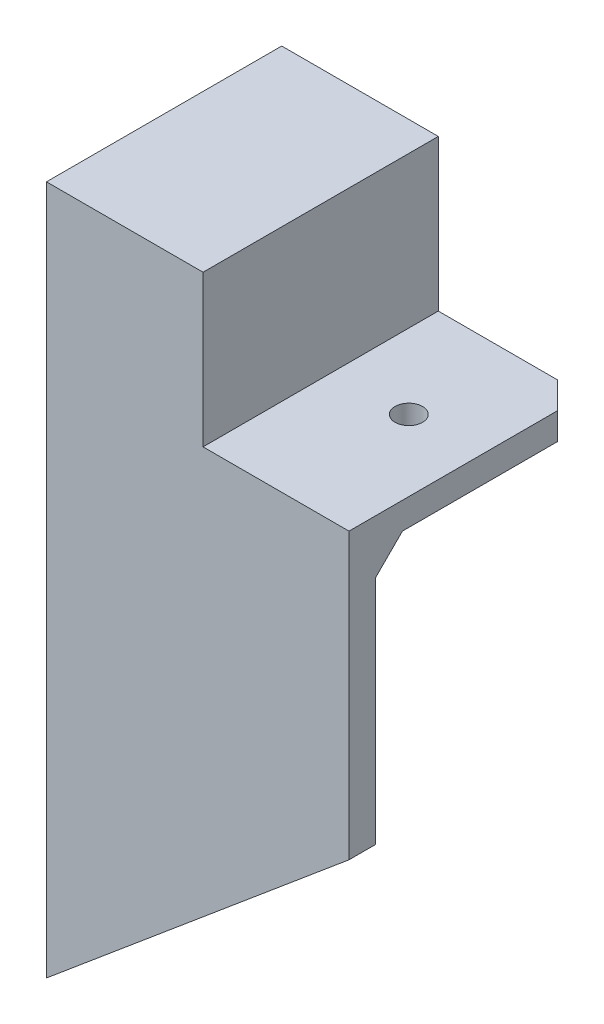
ISO-10303-21;
HEADER;
FILE_DESCRIPTION(('STEP AP214'),'2;1');
FILE_NAME('part.step','',(''),(''),'','','');
FILE_SCHEMA(('AUTOMOTIVE_DESIGN { 1 0 10303 214 1 1 1 1 }'));
ENDSEC;
DATA;
#1=APPLICATION_CONTEXT('core data for automotive mechanical design processes');
#2=APPLICATION_PROTOCOL_DEFINITION('international standard','automotive_design',2000,#1);
#3=PRODUCT_CONTEXT('',#1,'mechanical');
#4=PRODUCT('Part','Part','',(#3));
#5=PRODUCT_RELATED_PRODUCT_CATEGORY('part','',(#4));
#6=PRODUCT_DEFINITION_FORMATION('','',#4);
#7=PRODUCT_DEFINITION_CONTEXT('part definition',#1,'design');
#8=PRODUCT_DEFINITION('design','',#6,#7);
#9=PRODUCT_DEFINITION_SHAPE('','',#8);
#10=(LENGTH_UNIT() NAMED_UNIT(*) SI_UNIT(.MILLI.,.METRE.));
#11=(NAMED_UNIT(*) PLANE_ANGLE_UNIT() SI_UNIT($,.RADIAN.));
#12=(NAMED_UNIT(*) SI_UNIT($,.STERADIAN.) SOLID_ANGLE_UNIT());
#13=UNCERTAINTY_MEASURE_WITH_UNIT(LENGTH_MEASURE(1.E-05),#10,'distance_accuracy_value','');
#14=(GEOMETRIC_REPRESENTATION_CONTEXT(3) GLOBAL_UNCERTAINTY_ASSIGNED_CONTEXT((#13)) GLOBAL_UNIT_ASSIGNED_CONTEXT((#10,
#11,#12)) REPRESENTATION_CONTEXT('',''));
#15=CARTESIAN_POINT('',(0.,0.,0.));
#16=DIRECTION('',(0.,0.,1.));
#17=DIRECTION('',(1.,0.,0.));
#18=AXIS2_PLACEMENT_3D('',#15,#16,#17);
#19=CARTESIAN_POINT('',(0.,0.,-17.4752));
#20=DIRECTION('',(0.,0.,1.));
#21=DIRECTION('',(1.,0.,0.));
#22=AXIS2_PLACEMENT_3D('',#19,#20,#21);
#23=PLANE('',#22);
#24=DIRECTION('',(0.,-1.,0.));
#25=VECTOR('',#24,1.);
#26=CARTESIAN_POINT('',(108.667127984172,-84.1545398464944,-17.4752));
#27=LINE('',#26,#25);
#28=CARTESIAN_POINT('',(108.667127984172,14.27480000001,-17.4752));
#29=VERTEX_POINT('',#28);
#30=CARTESIAN_POINT('',(108.667127984172,-84.1545398464944,-17.4752));
#31=VERTEX_POINT('',#30);
#32=EDGE_CURVE('E307',#29,#31,#27,.T.);
#33=ORIENTED_EDGE('',*,*,#32,.F.);
#34=DIRECTION('',(1.,0.,0.));
#35=VECTOR('',#34,1.);
#36=CARTESIAN_POINT('',(0.,14.2748000000096,-17.4752));
#37=LINE('',#36,#35);
#38=CARTESIAN_POINT('',(112.559255968268,14.27480000001,-17.4752));
#39=VERTEX_POINT('',#38);
#40=EDGE_CURVE('E271',#29,#39,#37,.T.);
#41=ORIENTED_EDGE('',*,*,#40,.T.);
#42=CARTESIAN_POINT('',(112.559255968268,11.09980000001,-17.4752));
#43=DIRECTION('',(0.,0.,1.));
#44=DIRECTION('',(1.,0.,0.));
#45=AXIS2_PLACEMENT_3D('',#42,#43,#44);
#46=CIRCLE('',#45,3.17500000000004);
#47=CARTESIAN_POINT('',(115.542780039264,12.185713955069,-17.4752));
#48=VERTEX_POINT('',#47);
#49=EDGE_CURVE('E274',#39,#48,#46,.F.);
#50=ORIENTED_EDGE('',*,*,#49,.T.);
#51=DIRECTION('',(0.342020143325666,-0.939692620785908,0.));
#52=VECTOR('',#51,1.);
#53=CARTESIAN_POINT('',(105.943255288181,38.5601914461638,-17.4752));
#54=LINE('',#53,#52);
#55=CARTESIAN_POINT('',(124.605061599347,-12.7126999999988,-17.4752));
#56=VERTEX_POINT('',#55);
#57=EDGE_CURVE('E276',#48,#56,#54,.T.);
#58=ORIENTED_EDGE('',*,*,#57,.T.);
#59=DIRECTION('',(1.,0.,0.));
#60=VECTOR('',#59,1.);
#61=CARTESIAN_POINT('',(0.,-12.7126999999992,-17.4752));
#62=LINE('',#61,#60);
#63=CARTESIAN_POINT('',(158.750000000128,-12.7126999999987,-17.4752));
#64=VERTEX_POINT('',#63);
#65=EDGE_CURVE('E278',#56,#64,#62,.T.);
#66=ORIENTED_EDGE('',*,*,#65,.T.);
#67=DIRECTION('',(1.34280688056193E-12,1.,0.));
#68=VECTOR('',#67,1.);
#69=CARTESIAN_POINT('',(158.750000000072,-53.9749999999979,-17.4752));
#70=LINE('',#69,#68);
#71=CARTESIAN_POINT('',(158.750000000072,-53.9749999999979,-17.4752));
#72=VERTEX_POINT('',#71);
#73=EDGE_CURVE('E205',#72,#64,#70,.T.);
#74=ORIENTED_EDGE('',*,*,#73,.F.);
#75=DIRECTION('',(0.766370514024187,0.642398813226106,0.));
#76=VECTOR('',#75,1.);
#77=CARTESIAN_POINT('',(158.750000000072,-53.9749999999979,-17.4752));
#78=LINE('',#77,#76);
#79=CARTESIAN_POINT('',(104.775000000076,-99.2187499999914,-17.4752));
#80=VERTEX_POINT('',#79);
#81=EDGE_CURVE('E203',#80,#72,#78,.T.);
#82=ORIENTED_EDGE('',*,*,#81,.F.);
#83=DIRECTION('',(0.,1.,0.));
#84=VECTOR('',#83,1.);
#85=CARTESIAN_POINT('',(104.775000000076,0.,-17.4752));
#86=LINE('',#85,#84);
#87=CARTESIAN_POINT('',(104.775000000076,-84.1545398464944,-17.4752));
#88=VERTEX_POINT('',#87);
#89=EDGE_CURVE('E59',#80,#88,#86,.T.);
#90=ORIENTED_EDGE('',*,*,#89,.T.);
#91=DIRECTION('',(-1.,0.,0.));
#92=VECTOR('',#91,1.);
#93=CARTESIAN_POINT('',(104.775000000076,-84.1545398464944,-17.4752));
#94=LINE('',#93,#92);
#95=EDGE_CURVE('E54',#31,#88,#94,.T.);
#96=ORIENTED_EDGE('',*,*,#95,.F.);
#97=EDGE_LOOP('',(#33,#41,#50,#58,#66,#74,#82,#90,#96));
#98=FACE_BOUND('',#97,.T.);
#99=ADVANCED_FACE('F37',(#98),#23,.F.);
#100=CARTESIAN_POINT('',(104.775000000076,-99.2187499999912,-57.2235000000003));
#101=DIRECTION('',(1.,0.,0.));
#102=DIRECTION('',(0.,0.,-1.));
#103=AXIS2_PLACEMENT_3D('',#100,#101,#102);
#104=PLANE('',#103);
#105=CARTESIAN_POINT('',(104.775000000076,-74.62519999999,-23.876));
#106=DIRECTION('',(-1.,0.,0.));
#107=DIRECTION('',(0.,0.,1.));
#108=AXIS2_PLACEMENT_3D('',#105,#106,#107);
#109=CIRCLE('',#108,2.54);
#110=CARTESIAN_POINT('',(104.775000000076,-74.62519999999,-21.336));
#111=VERTEX_POINT('',#110);
#112=EDGE_CURVE('E303',#111,#111,#109,.T.);
#113=ORIENTED_EDGE('',*,*,#112,.F.);
#114=EDGE_LOOP('',(#113));
#115=FACE_BOUND('',#114,.T.);
#116=CARTESIAN_POINT('',(104.775000000076,1.57480000000997,-23.876));
#117=DIRECTION('',(-1.,0.,0.));
#118=DIRECTION('',(0.,0.,1.));
#119=AXIS2_PLACEMENT_3D('',#116,#117,#118);
#120=CIRCLE('',#119,2.54);
#121=CARTESIAN_POINT('',(104.775000000076,1.57480000000997,-21.336));
#122=VERTEX_POINT('',#121);
#123=EDGE_CURVE('E309',#122,#122,#120,.T.);
#124=ORIENTED_EDGE('',*,*,#123,.F.);
#125=EDGE_LOOP('',(#124));
#126=FACE_BOUND('',#125,.T.);
#127=DIRECTION('',(0.,0.,1.));
#128=VECTOR('',#127,1.);
#129=CARTESIAN_POINT('',(104.775000000076,-99.218749999991,-17.4752));
#130=LINE('',#129,#128);
#131=CARTESIAN_POINT('',(104.775000000076,-99.2187499999914,-12.7));
#132=VERTEX_POINT('',#131);
#133=EDGE_CURVE('E11',#80,#132,#130,.T.);
#134=ORIENTED_EDGE('',*,*,#133,.T.);
#135=DIRECTION('',(0.,-1.,0.));
#136=VECTOR('',#135,1.);
#137=CARTESIAN_POINT('',(104.775000000076,0.,-12.7));
#138=LINE('',#137,#136);
#139=CARTESIAN_POINT('',(104.775000000076,23.81250000001,-12.7));
#140=VERTEX_POINT('',#139);
#141=EDGE_CURVE('E296',#140,#132,#138,.T.);
#142=ORIENTED_EDGE('',*,*,#141,.F.);
#143=DIRECTION('',(0.,0.,1.));
#144=VECTOR('',#143,1.);
#145=CARTESIAN_POINT('',(104.775000000076,23.8125000000092,-227.168068425539));
#146=LINE('',#145,#144);
#147=CARTESIAN_POINT('',(104.775000000076,23.81250000001,-54.6734999999892));
#148=VERTEX_POINT('',#147);
#149=EDGE_CURVE('E294',#148,#140,#146,.T.);
#150=ORIENTED_EDGE('',*,*,#149,.F.);
#151=DIRECTION('',(0.,1.,0.));
#152=VECTOR('',#151,1.);
#153=CARTESIAN_POINT('',(104.775000000076,15.8749999999788,-54.6734999999892));
#154=LINE('',#153,#152);
#155=CARTESIAN_POINT('',(104.775000000076,19.03730000001,-54.6734999999892));
#156=VERTEX_POINT('',#155);
#157=EDGE_CURVE('E288',#156,#148,#154,.T.);
#158=ORIENTED_EDGE('',*,*,#157,.F.);
#159=DIRECTION('',(0.,0.,1.));
#160=VECTOR('',#159,1.);
#161=CARTESIAN_POINT('',(104.775000000076,19.0373000000092,-227.168068425538));
#162=LINE('',#161,#160);
#163=CARTESIAN_POINT('',(104.775000000076,19.0373000000099,-22.2377));
#164=VERTEX_POINT('',#163);
#165=EDGE_CURVE('E46',#156,#164,#162,.T.);
#166=ORIENTED_EDGE('',*,*,#165,.T.);
#167=DIRECTION('',(0.,0.707106781186542,-0.707106781186553));
#168=VECTOR('',#167,1.);
#169=CARTESIAN_POINT('',(104.775000000076,19.0373000000094,-22.2377000000002));
#170=LINE('',#169,#168);
#171=CARTESIAN_POINT('',(104.775000000076,14.27480000001,-17.4752));
#172=VERTEX_POINT('',#171);
#173=EDGE_CURVE('E185',#172,#164,#170,.T.);
#174=ORIENTED_EDGE('',*,*,#173,.F.);
#175=DIRECTION('',(0.,0.,1.));
#176=VECTOR('',#175,1.);
#177=CARTESIAN_POINT('',(104.775000000076,14.27480000001,-30.1752));
#178=LINE('',#177,#176);
#179=CARTESIAN_POINT('',(104.775000000076,14.27480000001,-30.1752));
#180=VERTEX_POINT('',#179);
#181=EDGE_CURVE('E168',#180,#172,#178,.T.);
#182=ORIENTED_EDGE('',*,*,#181,.F.);
#183=DIRECTION('',(0.,1.,0.));
#184=VECTOR('',#183,1.);
#185=CARTESIAN_POINT('',(104.775000000076,-84.1545398464944,-30.1752));
#186=LINE('',#185,#184);
#187=CARTESIAN_POINT('',(104.775000000076,-84.1545398464944,-30.1752));
#188=VERTEX_POINT('',#187);
#189=EDGE_CURVE('E174',#188,#180,#186,.T.);
#190=ORIENTED_EDGE('',*,*,#189,.F.);
#191=DIRECTION('',(0.,0.,1.));
#192=VECTOR('',#191,1.);
#193=CARTESIAN_POINT('',(104.775000000076,-84.1545398464944,-30.1752));
#194=LINE('',#193,#192);
#195=EDGE_CURVE('E318',#188,#88,#194,.T.);
#196=ORIENTED_EDGE('',*,*,#195,.T.);
#197=ORIENTED_EDGE('',*,*,#89,.F.);
#198=EDGE_LOOP('',(#134,#142,#150,#158,#166,#174,#182,#190,#196,#197));
#199=FACE_BOUND('',#198,.T.);
#200=ADVANCED_FACE('F39',(#115,#126,#199),#104,.F.);
#201=CARTESIAN_POINT('',(-10.7949999999356,19.0373000000096,-227.168068425538));
#202=DIRECTION('',(0.,-1.,0.));
#203=DIRECTION('',(1.,0.,0.));
#204=AXIS2_PLACEMENT_3D('',#201,#202,#203);
#205=PLANE('',#204);
#206=ORIENTED_EDGE('',*,*,#165,.F.);
#207=DIRECTION('',(-1.,0.,0.));
#208=VECTOR('',#207,1.);
#209=CARTESIAN_POINT('',(-10.7949999999356,19.0373000000096,-54.6734999999892));
#210=LINE('',#209,#208);
#211=CARTESIAN_POINT('',(112.559255968268,19.03730000001,-54.673499999989));
#212=VERTEX_POINT('',#211);
#213=EDGE_CURVE('E222',#212,#156,#210,.T.);
#214=ORIENTED_EDGE('',*,*,#213,.F.);
#215=DIRECTION('',(0.,0.,1.));
#216=VECTOR('',#215,1.);
#217=CARTESIAN_POINT('',(112.559255968268,19.03730000001,-17.4751999999999));
#218=LINE('',#217,#216);
#219=CARTESIAN_POINT('',(112.559255968268,19.03730000001,-22.2377));
#220=VERTEX_POINT('',#219);
#221=EDGE_CURVE('E228',#212,#220,#218,.T.);
#222=ORIENTED_EDGE('',*,*,#221,.T.);
#223=DIRECTION('',(-1.,0.,0.));
#224=VECTOR('',#223,1.);
#225=CARTESIAN_POINT('',(-10.7949999999356,19.0373000000096,-22.2377));
#226=LINE('',#225,#224);
#227=EDGE_CURVE('E284',#220,#164,#226,.T.);
#228=ORIENTED_EDGE('',*,*,#227,.T.);
#229=EDGE_LOOP('',(#206,#214,#222,#228));
#230=FACE_BOUND('',#229,.T.);
#231=ADVANCED_FACE('F364',(#230),#205,.T.);
#232=CARTESIAN_POINT('',(-10.7949999999356,19.0373000000096,-22.2377));
#233=DIRECTION('',(0.,0.707106781186553,0.707106781186542));
#234=DIRECTION('',(-1.,0.,0.));
#235=AXIS2_PLACEMENT_3D('',#232,#233,#234);
#236=PLANE('',#235);
#237=EDGE_CURVE('E272',#172,#29,#37,.T.);
#238=ORIENTED_EDGE('',*,*,#237,.F.);
#239=ORIENTED_EDGE('',*,*,#173,.T.);
#240=ORIENTED_EDGE('',*,*,#227,.F.);
#241=DIRECTION('',(0.,0.707106781186542,-0.707106781186553));
#242=VECTOR('',#241,1.);
#243=CARTESIAN_POINT('',(112.559255968268,14.27480000001,-17.4752));
#244=LINE('',#243,#242);
#245=EDGE_CURVE('E199',#39,#220,#244,.T.);
#246=ORIENTED_EDGE('',*,*,#245,.F.);
#247=ORIENTED_EDGE('',*,*,#40,.F.);
#248=EDGE_LOOP('',(#238,#239,#240,#246,#247));
#249=FACE_BOUND('',#248,.T.);
#250=ADVANCED_FACE('F329',(#249),#236,.F.);
#251=CARTESIAN_POINT('',(0.,0.,-12.7));
#252=DIRECTION('',(0.,0.,-1.));
#253=DIRECTION('',(-1.,0.,0.));
#254=AXIS2_PLACEMENT_3D('',#251,#252,#253);
#255=PLANE('',#254);
#256=DIRECTION('',(1.,0.,0.));
#257=VECTOR('',#256,1.);
#258=CARTESIAN_POINT('',(-10.7949999999356,23.8125000000096,-12.7));
#259=LINE('',#258,#257);
#260=CARTESIAN_POINT('',(132.71500000007,23.8125000000101,-12.7));
#261=VERTEX_POINT('',#260);
#262=EDGE_CURVE('E237',#140,#261,#259,.T.);
#263=ORIENTED_EDGE('',*,*,#262,.F.);
#264=ORIENTED_EDGE('',*,*,#141,.T.);
#265=DIRECTION('',(0.766370514024187,0.642398813226106,0.));
#266=VECTOR('',#265,1.);
#267=CARTESIAN_POINT('',(158.750000000072,-53.9749999999979,-12.7));
#268=LINE('',#267,#266);
#269=CARTESIAN_POINT('',(158.750000000072,-53.9749999999979,-12.7));
#270=VERTEX_POINT('',#269);
#271=EDGE_CURVE('E202',#132,#270,#268,.T.);
#272=ORIENTED_EDGE('',*,*,#271,.T.);
#273=DIRECTION('',(0.,-1.,0.));
#274=VECTOR('',#273,1.);
#275=CARTESIAN_POINT('',(158.75000000014,-3.17499999999868,-12.7));
#276=LINE('',#275,#274);
#277=CARTESIAN_POINT('',(158.75000000014,-3.17499999999868,-12.7));
#278=VERTEX_POINT('',#277);
#279=EDGE_CURVE('E212',#278,#270,#276,.T.);
#280=ORIENTED_EDGE('',*,*,#279,.F.);
#281=DIRECTION('',(1.,0.,0.));
#282=VECTOR('',#281,1.);
#283=CARTESIAN_POINT('',(132.71500000007,-3.17499999999876,-12.7));
#284=LINE('',#283,#282);
#285=CARTESIAN_POINT('',(132.71500000007,-3.17499999999876,-12.7));
#286=VERTEX_POINT('',#285);
#287=EDGE_CURVE('E231',#286,#278,#284,.T.);
#288=ORIENTED_EDGE('',*,*,#287,.F.);
#289=DIRECTION('',(0.,-1.,0.));
#290=VECTOR('',#289,1.);
#291=CARTESIAN_POINT('',(132.71500000007,23.8125000000101,-12.7));
#292=LINE('',#291,#290);
#293=EDGE_CURVE('E234',#261,#286,#292,.T.);
#294=ORIENTED_EDGE('',*,*,#293,.F.);
#295=EDGE_LOOP('',(#263,#264,#272,#280,#288,#294));
#296=FACE_BOUND('',#295,.T.);
#297=ADVANCED_FACE('F394',(#296),#255,.F.);
#298=CARTESIAN_POINT('',(127.93980000007,-7.95019999999877,-227.168068425539));
#299=DIRECTION('',(-0.939692620785908,-0.342020143325673,0.));
#300=DIRECTION('',(0.342020143325666,-0.939692620785908,0.));
#301=AXIS2_PLACEMENT_3D('',#298,#299,#300);
#302=PLANE('',#301);
#303=DIRECTION('',(0.,0.,1.));
#304=VECTOR('',#303,1.);
#305=CARTESIAN_POINT('',(127.93980000007,-7.95019999999877,-227.168068425539));
#306=LINE('',#305,#304);
#307=CARTESIAN_POINT('',(127.93980000007,-7.95019999999877,-54.6734999999892));
#308=VERTEX_POINT('',#307);
#309=CARTESIAN_POINT('',(127.93980000007,-7.95019999999877,-22.2377000000001));
#310=VERTEX_POINT('',#309);
#311=EDGE_CURVE('E216',#308,#310,#306,.T.);
#312=ORIENTED_EDGE('',*,*,#311,.T.);
#313=DIRECTION('',(-0.342020143325666,0.939692620785908,0.));
#314=VECTOR('',#313,1.);
#315=CARTESIAN_POINT('',(127.93980000007,-7.95019999999877,-22.2377));
#316=LINE('',#315,#314);
#317=CARTESIAN_POINT('',(120.018066145757,13.8145848876575,-22.2377));
#318=VERTEX_POINT('',#317);
#319=EDGE_CURVE('E280',#310,#318,#316,.T.);
#320=ORIENTED_EDGE('',*,*,#319,.T.);
#321=DIRECTION('',(0.,0.,1.));
#322=VECTOR('',#321,1.);
#323=CARTESIAN_POINT('',(120.018066145756,13.8145848876575,-54.6734999999892));
#324=LINE('',#323,#322);
#325=CARTESIAN_POINT('',(120.018066145756,13.8145848876575,-54.6734999999892));
#326=VERTEX_POINT('',#325);
#327=EDGE_CURVE('E255',#318,#326,#324,.F.);
#328=ORIENTED_EDGE('',*,*,#327,.T.);
#329=DIRECTION('',(-0.342020143325666,0.939692620785908,0.));
#330=VECTOR('',#329,1.);
#331=CARTESIAN_POINT('',(127.93980000007,-7.95019999999874,-54.6734999999892));
#332=LINE('',#331,#330);
#333=EDGE_CURVE('E225',#308,#326,#332,.T.);
#334=ORIENTED_EDGE('',*,*,#333,.F.);
#335=EDGE_LOOP('',(#312,#320,#328,#334));
#336=FACE_BOUND('',#335,.T.);
#337=ADVANCED_FACE('F355',(#336),#302,.T.);
#338=CARTESIAN_POINT('',(132.71500000007,-7.95019999999877,-227.168068425539));
#339=DIRECTION('',(0.,-1.,0.));
#340=DIRECTION('',(0.,0.,-1.));
#341=AXIS2_PLACEMENT_3D('',#338,#339,#340);
#342=PLANE('',#341);
#343=CARTESIAN_POINT('',(146.050000000081,-7.9501999999987,-36.0743499999948));
#344=DIRECTION('',(0.,-1.,0.));
#345=DIRECTION('',(0.,0.,-1.));
#346=AXIS2_PLACEMENT_3D('',#343,#344,#345);
#347=CIRCLE('',#346,2.45745);
#348=CARTESIAN_POINT('',(146.050000000081,-7.9501999999987,-38.5317999999948));
#349=VERTEX_POINT('',#348);
#350=EDGE_CURVE('E195',#349,#349,#347,.T.);
#351=ORIENTED_EDGE('',*,*,#350,.F.);
#352=EDGE_LOOP('',(#351));
#353=FACE_BOUND('',#352,.T.);
#354=DIRECTION('',(-1.,0.,0.));
#355=VECTOR('',#354,1.);
#356=CARTESIAN_POINT('',(132.71500000007,-7.95019999999877,-54.6734999999892));
#357=LINE('',#356,#355);
#358=CARTESIAN_POINT('',(153.98750000014,-7.9501999999987,-54.6734999999892));
#359=VERTEX_POINT('',#358);
#360=EDGE_CURVE('E226',#359,#308,#357,.T.);
#361=ORIENTED_EDGE('',*,*,#360,.F.);
#362=DIRECTION('',(-0.707106781186548,0.,-0.707106781186547));
#363=VECTOR('',#362,1.);
#364=CARTESIAN_POINT('',(57.1039657873309,-7.95019999999899,-151.557034212799));
#365=LINE('',#364,#363);
#366=CARTESIAN_POINT('',(158.75000000014,-7.9501999999987,-49.9109999999893));
#367=VERTEX_POINT('',#366);
#368=EDGE_CURVE('E269',#359,#367,#365,.F.);
#369=ORIENTED_EDGE('',*,*,#368,.T.);
#370=DIRECTION('',(0.,0.,1.));
#371=VECTOR('',#370,1.);
#372=CARTESIAN_POINT('',(158.75000000014,-7.9501999999987,-227.168068425539));
#373=LINE('',#372,#371);
#374=CARTESIAN_POINT('',(158.75000000014,-7.95019999999867,-22.2377));
#375=VERTEX_POINT('',#374);
#376=EDGE_CURVE('E239',#367,#375,#373,.T.);
#377=ORIENTED_EDGE('',*,*,#376,.T.);
#378=DIRECTION('',(-1.,0.,0.));
#379=VECTOR('',#378,1.);
#380=CARTESIAN_POINT('',(132.71500000007,-7.95019999999877,-22.2377));
#381=LINE('',#380,#379);
#382=EDGE_CURVE('E266',#375,#310,#381,.T.);
#383=ORIENTED_EDGE('',*,*,#382,.T.);
#384=ORIENTED_EDGE('',*,*,#311,.F.);
#385=EDGE_LOOP('',(#361,#369,#377,#383,#384));
#386=FACE_BOUND('',#385,.T.);
#387=ADVANCED_FACE('F352',(#353,#386),#342,.T.);
#388=CARTESIAN_POINT('',(158.75000000014,-3.17499999999868,-227.168068425539));
#389=DIRECTION('',(-1.,0.,0.));
#390=DIRECTION('',(0.,0.,1.));
#391=AXIS2_PLACEMENT_3D('',#388,#389,#390);
#392=PLANE('',#391);
#393=ORIENTED_EDGE('',*,*,#376,.F.);
#394=DIRECTION('',(0.,1.,0.));
#395=VECTOR('',#394,1.);
#396=CARTESIAN_POINT('',(158.75000000014,-3.17499999999866,-49.9109999999892));
#397=LINE('',#396,#395);
#398=CARTESIAN_POINT('',(158.75000000014,-3.17499999999868,-49.9109999999893));
#399=VERTEX_POINT('',#398);
#400=EDGE_CURVE('E259',#367,#399,#397,.T.);
#401=ORIENTED_EDGE('',*,*,#400,.T.);
#402=DIRECTION('',(0.,0.,1.));
#403=VECTOR('',#402,1.);
#404=CARTESIAN_POINT('',(158.75000000014,-3.17499999999868,-227.168068425539));
#405=LINE('',#404,#403);
#406=EDGE_CURVE('E247',#399,#278,#405,.T.);
#407=ORIENTED_EDGE('',*,*,#406,.T.);
#408=ORIENTED_EDGE('',*,*,#279,.T.);
#409=DIRECTION('',(0.,0.,1.));
#410=VECTOR('',#409,1.);
#411=CARTESIAN_POINT('',(158.750000000072,-53.9749999999979,-17.4752));
#412=LINE('',#411,#410);
#413=EDGE_CURVE('E208',#72,#270,#412,.T.);
#414=ORIENTED_EDGE('',*,*,#413,.F.);
#415=ORIENTED_EDGE('',*,*,#73,.T.);
#416=DIRECTION('',(0.,0.707106781186542,-0.707106781186553));
#417=VECTOR('',#416,1.);
#418=CARTESIAN_POINT('',(158.75000000014,96.9025842127704,-127.090484212771));
#419=LINE('',#418,#417);
#420=EDGE_CURVE('E287',#64,#375,#419,.T.);
#421=ORIENTED_EDGE('',*,*,#420,.T.);
#422=EDGE_LOOP('',(#393,#401,#407,#408,#414,#415,#421));
#423=FACE_BOUND('',#422,.T.);
#424=ADVANCED_FACE('F385',(#423),#392,.F.);
#425=CARTESIAN_POINT('',(132.71500000007,-3.17499999999876,-227.168068425539));
#426=DIRECTION('',(0.,-1.,0.));
#427=DIRECTION('',(0.,0.,-1.));
#428=AXIS2_PLACEMENT_3D('',#425,#426,#427);
#429=PLANE('',#428);
#430=CARTESIAN_POINT('',(146.050000000081,-3.17499999999873,-36.0743499999948));
#431=DIRECTION('',(0.,-1.,0.));
#432=DIRECTION('',(0.,0.,-1.));
#433=AXIS2_PLACEMENT_3D('',#430,#431,#432);
#434=CIRCLE('',#433,2.45745);
#435=CARTESIAN_POINT('',(146.050000000081,-3.17499999999873,-38.5317999999948));
#436=VERTEX_POINT('',#435);
#437=EDGE_CURVE('E198',#436,#436,#434,.T.);
#438=ORIENTED_EDGE('',*,*,#437,.T.);
#439=EDGE_LOOP('',(#438));
#440=FACE_BOUND('',#439,.T.);
#441=ORIENTED_EDGE('',*,*,#406,.F.);
#442=DIRECTION('',(0.707106781186548,0.,0.707106781186547));
#443=VECTOR('',#442,1.);
#444=CARTESIAN_POINT('',(158.75000000014,-3.17499999999868,-49.9109999999892));
#445=LINE('',#444,#443);
#446=CARTESIAN_POINT('',(153.98750000014,-3.1749999999987,-54.6734999999892));
#447=VERTEX_POINT('',#446);
#448=EDGE_CURVE('E262',#399,#447,#445,.F.);
#449=ORIENTED_EDGE('',*,*,#448,.T.);
#450=DIRECTION('',(-1.,0.,0.));
#451=VECTOR('',#450,1.);
#452=CARTESIAN_POINT('',(132.71500000007,-3.17499999999876,-54.6734999999892));
#453=LINE('',#452,#451);
#454=CARTESIAN_POINT('',(132.71500000007,-3.17499999999876,-54.6734999999892));
#455=VERTEX_POINT('',#454);
#456=EDGE_CURVE('E213',#447,#455,#453,.T.);
#457=ORIENTED_EDGE('',*,*,#456,.T.);
#458=DIRECTION('',(0.,0.,1.));
#459=VECTOR('',#458,1.);
#460=CARTESIAN_POINT('',(132.71500000007,-3.17499999999876,-227.168068425539));
#461=LINE('',#460,#459);
#462=EDGE_CURVE('E245',#455,#286,#461,.T.);
#463=ORIENTED_EDGE('',*,*,#462,.T.);
#464=ORIENTED_EDGE('',*,*,#287,.T.);
#465=EDGE_LOOP('',(#441,#449,#457,#463,#464));
#466=FACE_BOUND('',#465,.T.);
#467=ADVANCED_FACE('F396',(#440,#466),#429,.F.);
#468=CARTESIAN_POINT('',(132.71500000007,23.8125000000101,-227.168068425539));
#469=DIRECTION('',(-1.,0.,0.));
#470=DIRECTION('',(0.,0.,1.));
#471=AXIS2_PLACEMENT_3D('',#468,#469,#470);
#472=PLANE('',#471);
#473=ORIENTED_EDGE('',*,*,#293,.T.);
#474=ORIENTED_EDGE('',*,*,#462,.F.);
#475=DIRECTION('',(0.,1.,0.));
#476=VECTOR('',#475,1.);
#477=CARTESIAN_POINT('',(132.71500000007,23.8125000000102,-54.6734999999892));
#478=LINE('',#477,#476);
#479=CARTESIAN_POINT('',(132.71500000007,23.8125000000101,-54.6734999999892));
#480=VERTEX_POINT('',#479);
#481=EDGE_CURVE('E215',#455,#480,#478,.T.);
#482=ORIENTED_EDGE('',*,*,#481,.T.);
#483=DIRECTION('',(0.,0.,1.));
#484=VECTOR('',#483,1.);
#485=CARTESIAN_POINT('',(132.71500000007,23.8125000000101,-227.168068425539));
#486=LINE('',#485,#484);
#487=EDGE_CURVE('E242',#480,#261,#486,.T.);
#488=ORIENTED_EDGE('',*,*,#487,.T.);
#489=EDGE_LOOP('',(#473,#474,#482,#488));
#490=FACE_BOUND('',#489,.T.);
#491=ADVANCED_FACE('F376',(#490),#472,.F.);
#492=CARTESIAN_POINT('',(-10.7949999999356,23.8125000000096,-227.168068425539));
#493=DIRECTION('',(0.,-1.,0.));
#494=DIRECTION('',(1.,0.,0.));
#495=AXIS2_PLACEMENT_3D('',#492,#493,#494);
#496=PLANE('',#495);
#497=DIRECTION('',(-1.,0.,0.));
#498=VECTOR('',#497,1.);
#499=CARTESIAN_POINT('',(-10.7949999999356,23.8125000000096,-54.6734999999892));
#500=LINE('',#499,#498);
#501=EDGE_CURVE('E219',#480,#148,#500,.T.);
#502=ORIENTED_EDGE('',*,*,#501,.T.);
#503=ORIENTED_EDGE('',*,*,#149,.T.);
#504=ORIENTED_EDGE('',*,*,#262,.T.);
#505=ORIENTED_EDGE('',*,*,#487,.F.);
#506=EDGE_LOOP('',(#502,#503,#504,#505));
#507=FACE_BOUND('',#506,.T.);
#508=ADVANCED_FACE('F372',(#507),#496,.F.);
#509=CARTESIAN_POINT('',(132.715000000078,15.8749999999788,-54.6734999999892));
#510=DIRECTION('',(0.,0.,1.));
#511=DIRECTION('',(1.,0.,0.));
#512=AXIS2_PLACEMENT_3D('',#509,#510,#511);
#513=PLANE('',#512);
#514=ORIENTED_EDGE('',*,*,#213,.T.);
#515=ORIENTED_EDGE('',*,*,#157,.T.);
#516=ORIENTED_EDGE('',*,*,#501,.F.);
#517=ORIENTED_EDGE('',*,*,#481,.F.);
#518=ORIENTED_EDGE('',*,*,#456,.F.);
#519=DIRECTION('',(0.,-1.,0.));
#520=VECTOR('',#519,1.);
#521=CARTESIAN_POINT('',(153.98750000014,15.8749999999788,-54.6734999999892));
#522=LINE('',#521,#520);
#523=EDGE_CURVE('E264',#447,#359,#522,.T.);
#524=ORIENTED_EDGE('',*,*,#523,.T.);
#525=ORIENTED_EDGE('',*,*,#360,.T.);
#526=ORIENTED_EDGE('',*,*,#333,.T.);
#527=CARTESIAN_POINT('',(112.559255968268,11.09980000001,-54.6734999999892));
#528=DIRECTION('',(0.,0.,1.));
#529=DIRECTION('',(1.,0.,0.));
#530=AXIS2_PLACEMENT_3D('',#527,#528,#529);
#531=CIRCLE('',#530,7.9375);
#532=EDGE_CURVE('E257',#326,#212,#531,.T.);
#533=ORIENTED_EDGE('',*,*,#532,.T.);
#534=EDGE_LOOP('',(#514,#515,#516,#517,#518,#524,#525,#526,#533));
#535=FACE_BOUND('',#534,.T.);
#536=ADVANCED_FACE('F358',(#535),#513,.F.);
#537=CARTESIAN_POINT('',(158.750000000072,-53.9749999999979,-17.4752));
#538=DIRECTION('',(0.6423988132261,-0.766370514024184,0.));
#539=DIRECTION('',(0.766370514024187,0.642398813226107,0.));
#540=AXIS2_PLACEMENT_3D('',#537,#538,#539);
#541=PLANE('',#540);
#542=ORIENTED_EDGE('',*,*,#133,.F.);
#543=ORIENTED_EDGE('',*,*,#81,.T.);
#544=ORIENTED_EDGE('',*,*,#413,.T.);
#545=ORIENTED_EDGE('',*,*,#271,.F.);
#546=EDGE_LOOP('',(#542,#543,#544,#545));
#547=FACE_BOUND('',#546,.T.);
#548=ADVANCED_FACE('F390',(#547),#541,.T.);
#549=CARTESIAN_POINT('',(146.050000000081,-7.9501999999987,-36.0743499999948));
#550=DIRECTION('',(0.,-1.,0.));
#551=DIRECTION('',(0.,0.,-1.));
#552=AXIS2_PLACEMENT_3D('',#549,#550,#551);
#553=CYLINDRICAL_SURFACE('',#552,2.45745);
#554=ORIENTED_EDGE('',*,*,#437,.F.);
#555=EDGE_LOOP('',(#554));
#556=FACE_BOUND('',#555,.T.);
#557=ORIENTED_EDGE('',*,*,#350,.T.);
#558=EDGE_LOOP('',(#557));
#559=FACE_BOUND('',#558,.T.);
#560=ADVANCED_FACE('F415',(#556,#559),#553,.F.);
#561=CARTESIAN_POINT('',(112.559255968268,11.09980000001,-227.168068425539));
#562=DIRECTION('',(0.,0.,-1.));
#563=DIRECTION('',(-1.,0.,0.));
#564=AXIS2_PLACEMENT_3D('',#561,#562,#563);
#565=CYLINDRICAL_SURFACE('',#564,7.9375);
#566=ORIENTED_EDGE('',*,*,#327,.F.);
#567=CARTESIAN_POINT('',(112.559255968268,11.09980000001,-22.2377));
#568=DIRECTION('',(0.,0.,1.));
#569=DIRECTION('',(1.,0.,0.));
#570=AXIS2_PLACEMENT_3D('',#567,#568,#569);
#571=CIRCLE('',#570,7.9375);
#572=EDGE_CURVE('E282',#318,#220,#571,.T.);
#573=ORIENTED_EDGE('',*,*,#572,.T.);
#574=ORIENTED_EDGE('',*,*,#221,.F.);
#575=ORIENTED_EDGE('',*,*,#532,.F.);
#576=EDGE_LOOP('',(#566,#573,#574,#575));
#577=FACE_BOUND('',#576,.T.);
#578=ADVANCED_FACE('F362',(#577),#565,.F.);
#579=CARTESIAN_POINT('',(158.75000000014,-3.17499999999866,-49.9109999999892));
#580=DIRECTION('',(-0.707106781186547,0.,0.707106781186548));
#581=DIRECTION('',(0.,1.,0.));
#582=AXIS2_PLACEMENT_3D('',#579,#580,#581);
#583=PLANE('',#582);
#584=ORIENTED_EDGE('',*,*,#368,.F.);
#585=ORIENTED_EDGE('',*,*,#523,.F.);
#586=ORIENTED_EDGE('',*,*,#448,.F.);
#587=ORIENTED_EDGE('',*,*,#400,.F.);
#588=EDGE_LOOP('',(#584,#585,#586,#587));
#589=FACE_BOUND('',#588,.T.);
#590=ADVANCED_FACE('F382',(#589),#583,.F.);
#591=CARTESIAN_POINT('',(112.559255968268,11.09980000001,-17.4751999999999));
#592=DIRECTION('',(0.,0.,-1.));
#593=DIRECTION('',(-1.,0.,0.));
#594=AXIS2_PLACEMENT_3D('',#591,#592,#593);
#595=CONICAL_SURFACE('',#594,3.17500000000002,0.78539816339744);
#596=ORIENTED_EDGE('',*,*,#245,.T.);
#597=ORIENTED_EDGE('',*,*,#572,.F.);
#598=DIRECTION('',(0.66446302438867,0.241844762647975,-0.707106781186554));
#599=VECTOR('',#598,1.);
#600=CARTESIAN_POINT('',(115.542780039264,12.185713955069,-17.4752));
#601=LINE('',#600,#599);
#602=EDGE_CURVE('E189',#48,#318,#601,.T.);
#603=ORIENTED_EDGE('',*,*,#602,.F.);
#604=ORIENTED_EDGE('',*,*,#49,.F.);
#605=EDGE_LOOP('',(#596,#597,#603,#604));
#606=FACE_BOUND('',#605,.T.);
#607=ADVANCED_FACE('F335',(#606),#595,.F.);
#608=CARTESIAN_POINT('',(127.93980000007,-7.95019999999877,-22.2377));
#609=DIRECTION('',(0.664463024388679,0.241844762647979,0.707106781186543));
#610=DIRECTION('',(-0.342020143325666,0.939692620785908,0.));
#611=AXIS2_PLACEMENT_3D('',#608,#609,#610);
#612=PLANE('',#611);
#613=ORIENTED_EDGE('',*,*,#602,.T.);
#614=ORIENTED_EDGE('',*,*,#319,.F.);
#615=DIRECTION('',(-0.443712606279659,-0.633687274224639,0.633687274224646));
#616=VECTOR('',#615,1.);
#617=CARTESIAN_POINT('',(127.93980000007,-7.95019999999877,-22.2377));
#618=LINE('',#617,#616);
#619=EDGE_CURVE('E187',#56,#310,#618,.F.);
#620=ORIENTED_EDGE('',*,*,#619,.F.);
#621=ORIENTED_EDGE('',*,*,#57,.F.);
#622=EDGE_LOOP('',(#613,#614,#620,#621));
#623=FACE_BOUND('',#622,.T.);
#624=ADVANCED_FACE('F346',(#623),#612,.F.);
#625=CARTESIAN_POINT('',(132.71500000007,-7.95019999999877,-22.2377));
#626=DIRECTION('',(0.,0.707106781186553,0.707106781186542));
#627=DIRECTION('',(-1.,0.,0.));
#628=AXIS2_PLACEMENT_3D('',#625,#626,#627);
#629=PLANE('',#628);
#630=ORIENTED_EDGE('',*,*,#420,.F.);
#631=ORIENTED_EDGE('',*,*,#65,.F.);
#632=ORIENTED_EDGE('',*,*,#619,.T.);
#633=ORIENTED_EDGE('',*,*,#382,.F.);
#634=EDGE_LOOP('',(#630,#631,#632,#633));
#635=FACE_BOUND('',#634,.T.);
#636=ADVANCED_FACE('F343',(#635),#629,.F.);
#637=CARTESIAN_POINT('',(104.775000000076,14.27480000001,-30.1752));
#638=DIRECTION('',(0.,-1.,0.));
#639=DIRECTION('',(0.,0.,-1.));
#640=AXIS2_PLACEMENT_3D('',#637,#638,#639);
#641=PLANE('',#640);
#642=ORIENTED_EDGE('',*,*,#237,.T.);
#643=DIRECTION('',(0.,0.,1.));
#644=VECTOR('',#643,1.);
#645=CARTESIAN_POINT('',(108.667127984172,14.27480000001,-30.1752));
#646=LINE('',#645,#644);
#647=CARTESIAN_POINT('',(108.667127984172,14.27480000001,-30.1752));
#648=VERTEX_POINT('',#647);
#649=EDGE_CURVE('E170',#648,#29,#646,.T.);
#650=ORIENTED_EDGE('',*,*,#649,.F.);
#651=DIRECTION('',(1.,0.,0.));
#652=VECTOR('',#651,1.);
#653=CARTESIAN_POINT('',(104.775000000076,14.27480000001,-30.1752));
#654=LINE('',#653,#652);
#655=EDGE_CURVE('E163',#180,#648,#654,.T.);
#656=ORIENTED_EDGE('',*,*,#655,.F.);
#657=ORIENTED_EDGE('',*,*,#181,.T.);
#658=EDGE_LOOP('',(#642,#650,#656,#657));
#659=FACE_BOUND('',#658,.T.);
#660=ADVANCED_FACE('F166',(#659),#641,.F.);
#661=CARTESIAN_POINT('',(108.667127984172,-84.1545398464944,-30.1752));
#662=DIRECTION('',(-1.,0.,0.));
#663=DIRECTION('',(0.,0.,1.));
#664=AXIS2_PLACEMENT_3D('',#661,#662,#663);
#665=PLANE('',#664);
#666=CARTESIAN_POINT('',(108.667127984172,-74.62519999999,-23.876));
#667=DIRECTION('',(-1.,0.,0.));
#668=DIRECTION('',(0.,0.,1.));
#669=AXIS2_PLACEMENT_3D('',#666,#667,#668);
#670=CIRCLE('',#669,2.54);
#671=CARTESIAN_POINT('',(108.667127984172,-74.62519999999,-21.336));
#672=VERTEX_POINT('',#671);
#673=EDGE_CURVE('E41',#672,#672,#670,.T.);
#674=ORIENTED_EDGE('',*,*,#673,.T.);
#675=EDGE_LOOP('',(#674));
#676=FACE_BOUND('',#675,.T.);
#677=CARTESIAN_POINT('',(108.667127984172,1.57480000000997,-23.876));
#678=DIRECTION('',(-1.,0.,0.));
#679=DIRECTION('',(0.,0.,1.));
#680=AXIS2_PLACEMENT_3D('',#677,#678,#679);
#681=CIRCLE('',#680,2.54);
#682=CARTESIAN_POINT('',(108.667127984172,1.57480000000997,-21.336));
#683=VERTEX_POINT('',#682);
#684=EDGE_CURVE('E301',#683,#683,#681,.T.);
#685=ORIENTED_EDGE('',*,*,#684,.T.);
#686=EDGE_LOOP('',(#685));
#687=FACE_BOUND('',#686,.T.);
#688=ORIENTED_EDGE('',*,*,#32,.T.);
#689=DIRECTION('',(0.,0.,1.));
#690=VECTOR('',#689,1.);
#691=CARTESIAN_POINT('',(108.667127984172,-84.1545398464944,-30.1752));
#692=LINE('',#691,#690);
#693=CARTESIAN_POINT('',(108.667127984172,-84.1545398464944,-30.1752));
#694=VERTEX_POINT('',#693);
#695=EDGE_CURVE('E191',#694,#31,#692,.T.);
#696=ORIENTED_EDGE('',*,*,#695,.F.);
#697=DIRECTION('',(0.,-1.,0.));
#698=VECTOR('',#697,1.);
#699=CARTESIAN_POINT('',(108.667127984172,-84.1545398464944,-30.1752));
#700=LINE('',#699,#698);
#701=EDGE_CURVE('E173',#648,#694,#700,.T.);
#702=ORIENTED_EDGE('',*,*,#701,.F.);
#703=ORIENTED_EDGE('',*,*,#649,.T.);
#704=EDGE_LOOP('',(#688,#696,#702,#703));
#705=FACE_BOUND('',#704,.T.);
#706=ADVANCED_FACE('F326',(#676,#687,#705),#665,.F.);
#707=CARTESIAN_POINT('',(104.775000000076,-84.1545398464944,-30.1752));
#708=DIRECTION('',(0.,1.,0.));
#709=DIRECTION('',(0.,0.,1.));
#710=AXIS2_PLACEMENT_3D('',#707,#708,#709);
#711=PLANE('',#710);
#712=ORIENTED_EDGE('',*,*,#95,.T.);
#713=ORIENTED_EDGE('',*,*,#195,.F.);
#714=DIRECTION('',(-1.,0.,0.));
#715=VECTOR('',#714,1.);
#716=CARTESIAN_POINT('',(104.775000000076,-84.1545398464944,-30.1752));
#717=LINE('',#716,#715);
#718=EDGE_CURVE('E179',#694,#188,#717,.T.);
#719=ORIENTED_EDGE('',*,*,#718,.F.);
#720=ORIENTED_EDGE('',*,*,#695,.T.);
#721=EDGE_LOOP('',(#712,#713,#719,#720));
#722=FACE_BOUND('',#721,.T.);
#723=ADVANCED_FACE('F324',(#722),#711,.F.);
#724=CARTESIAN_POINT('',(0.,0.,-30.1752));
#725=DIRECTION('',(0.,0.,-1.));
#726=DIRECTION('',(-1.,0.,0.));
#727=AXIS2_PLACEMENT_3D('',#724,#725,#726);
#728=PLANE('',#727);
#729=ORIENTED_EDGE('',*,*,#189,.T.);
#730=ORIENTED_EDGE('',*,*,#655,.T.);
#731=ORIENTED_EDGE('',*,*,#701,.T.);
#732=ORIENTED_EDGE('',*,*,#718,.T.);
#733=EDGE_LOOP('',(#729,#730,#731,#732));
#734=FACE_BOUND('',#733,.T.);
#735=ADVANCED_FACE('F177',(#734),#728,.T.);
#736=CARTESIAN_POINT('',(117.475000000076,1.57480000000997,-23.876));
#737=DIRECTION('',(-1.,0.,0.));
#738=DIRECTION('',(0.,0.,1.));
#739=AXIS2_PLACEMENT_3D('',#736,#737,#738);
#740=CYLINDRICAL_SURFACE('',#739,2.54);
#741=CARTESIAN_POINT('',(104.775000000076,1.57480000000997,-21.336));
#742=CARTESIAN_POINT('',(104.81554299991,1.57480000000997,-21.336));
#743=CARTESIAN_POINT('',(104.856085999744,1.57480000000997,-21.336));
#744=CARTESIAN_POINT('',(104.937171999413,1.57480000000997,-21.336));
#745=CARTESIAN_POINT('',(104.977714999247,1.57480000000997,-21.336));
#746=CARTESIAN_POINT('',(105.058800998916,1.57480000000997,-21.336));
#747=CARTESIAN_POINT('',(105.09934399875,1.57480000000997,-21.336));
#748=CARTESIAN_POINT('',(105.180429998419,1.57480000000997,-21.336));
#749=CARTESIAN_POINT('',(105.220972998253,1.57480000000997,-21.336));
#750=CARTESIAN_POINT('',(105.302058997922,1.57480000000997,-21.336));
#751=CARTESIAN_POINT('',(105.342601997756,1.57480000000997,-21.336));
#752=CARTESIAN_POINT('',(105.423687997425,1.57480000000997,-21.336));
#753=CARTESIAN_POINT('',(105.464230997259,1.57480000000997,-21.336));
#754=CARTESIAN_POINT('',(105.545316996928,1.57480000000997,-21.336));
#755=CARTESIAN_POINT('',(105.585859996762,1.57480000000997,-21.336));
#756=CARTESIAN_POINT('',(105.666945996431,1.57480000000997,-21.336));
#757=CARTESIAN_POINT('',(105.707488996265,1.57480000000997,-21.336));
#758=CARTESIAN_POINT('',(105.788574995934,1.57480000000997,-21.336));
#759=CARTESIAN_POINT('',(105.829117995768,1.57480000000997,-21.336));
#760=CARTESIAN_POINT('',(105.910203995437,1.57480000000997,-21.336));
#761=CARTESIAN_POINT('',(105.950746995271,1.57480000000997,-21.336));
#762=CARTESIAN_POINT('',(106.03183299494,1.57480000000997,-21.336));
#763=CARTESIAN_POINT('',(106.072375994774,1.57480000000997,-21.336));
#764=CARTESIAN_POINT('',(106.153461994443,1.57480000000997,-21.336));
#765=CARTESIAN_POINT('',(106.194004994278,1.57480000000997,-21.336));
#766=CARTESIAN_POINT('',(106.275090993946,1.57480000000997,-21.336));
#767=CARTESIAN_POINT('',(106.315633993781,1.57480000000997,-21.336));
#768=CARTESIAN_POINT('',(106.396719993449,1.57480000000997,-21.336));
#769=CARTESIAN_POINT('',(106.437262993284,1.57480000000997,-21.336));
#770=CARTESIAN_POINT('',(106.518348992952,1.57480000000997,-21.336));
#771=CARTESIAN_POINT('',(106.558891992787,1.57480000000997,-21.336));
#772=CARTESIAN_POINT('',(106.639977992455,1.57480000000997,-21.336));
#773=CARTESIAN_POINT('',(106.68052099229,1.57480000000997,-21.336));
#774=CARTESIAN_POINT('',(106.761606991958,1.57480000000997,-21.336));
#775=CARTESIAN_POINT('',(106.802149991793,1.57480000000997,-21.336));
#776=CARTESIAN_POINT('',(106.883235991461,1.57480000000997,-21.336));
#777=CARTESIAN_POINT('',(106.923778991296,1.57480000000997,-21.336));
#778=CARTESIAN_POINT('',(107.004864990964,1.57480000000997,-21.336));
#779=CARTESIAN_POINT('',(107.045407990799,1.57480000000997,-21.336));
#780=CARTESIAN_POINT('',(107.126493990467,1.57480000000997,-21.336));
#781=CARTESIAN_POINT('',(107.167036990302,1.57480000000997,-21.336));
#782=CARTESIAN_POINT('',(107.24812298997,1.57480000000997,-21.336));
#783=CARTESIAN_POINT('',(107.288665989805,1.57480000000997,-21.336));
#784=CARTESIAN_POINT('',(107.369751989473,1.57480000000997,-21.336));
#785=CARTESIAN_POINT('',(107.410294989308,1.57480000000997,-21.336));
#786=CARTESIAN_POINT('',(107.491380988976,1.57480000000997,-21.336));
#787=CARTESIAN_POINT('',(107.531923988811,1.57480000000997,-21.336));
#788=CARTESIAN_POINT('',(107.613009988479,1.57480000000997,-21.336));
#789=CARTESIAN_POINT('',(107.653552988314,1.57480000000997,-21.336));
#790=CARTESIAN_POINT('',(107.734638987982,1.57480000000997,-21.336));
#791=CARTESIAN_POINT('',(107.775181987817,1.57480000000997,-21.336));
#792=CARTESIAN_POINT('',(107.856267987485,1.57480000000997,-21.336));
#793=CARTESIAN_POINT('',(107.89681098732,1.57480000000997,-21.336));
#794=CARTESIAN_POINT('',(107.977896986988,1.57480000000997,-21.336));
#795=CARTESIAN_POINT('',(108.018439986823,1.57480000000997,-21.336));
#796=CARTESIAN_POINT('',(108.099525986491,1.57480000000997,-21.336));
#797=CARTESIAN_POINT('',(108.140068986326,1.57480000000997,-21.336));
#798=CARTESIAN_POINT('',(108.221154985994,1.57480000000997,-21.336));
#799=CARTESIAN_POINT('',(108.261697985829,1.57480000000997,-21.336));
#800=CARTESIAN_POINT('',(108.342783985497,1.57480000000997,-21.336));
#801=CARTESIAN_POINT('',(108.383326985332,1.57480000000997,-21.336));
#802=CARTESIAN_POINT('',(108.464412985,1.57480000000997,-21.336));
#803=CARTESIAN_POINT('',(108.504955984835,1.57480000000997,-21.336));
#804=CARTESIAN_POINT('',(108.586041984503,1.57480000000997,-21.336));
#805=CARTESIAN_POINT('',(108.626584984338,1.57480000000997,-21.336));
#806=CARTESIAN_POINT('',(108.667127984172,1.57480000000997,-21.336));
#807=B_SPLINE_CURVE_WITH_KNOTS('',3,(#741,#742,#743,#744,#745,#746,#747,#748,#749,#750,#751,
#752,#753,#754,#755,#756,#757,#758,#759,#760,#761,#762,#763,#764,#765,#766,#767,#768,#769,#770,
#771,#772,#773,#774,#775,#776,#777,#778,#779,#780,#781,#782,#783,#784,#785,#786,#787,#788,#789,
#790,#791,#792,#793,#794,#795,#796,#797,#798,#799,#800,#801,#802,#803,#804,#805,#806),
.UNSPECIFIED.,.F.,.F.,(4,2,2,2,2,2,2,2,2,2,2,2,2,2,2,2,2,2,2,2,2,2,2,2,2,2,2,2,2,2,2,2,4),(0.,
0.121628999503021,0.243257999006027,0.364886998509034,0.486515998012041,0.608144997515062,
0.729773997018068,0.851402996521075,0.973031996024096,1.0946609955271,1.21628999503011,
1.33791899453313,1.45954799403614,1.58117699353914,1.70280599304215,1.82443499254517,
1.94606399204818,2.06769299155118,2.1893219910542,2.31095099055721,2.43257999006022,
2.55420898956323,2.67583798906625,2.79746698856925,2.91909598807226,3.04072498757528,
3.16235398707829,3.28398298658129,3.40561198608431,3.52724098558732,3.64886998509033,
3.77049898459333,3.89212798409635),.UNSPECIFIED.);
#808=EDGE_CURVE('BSEAM510',#122,#683,#807,.T.);
#809=ORIENTED_EDGE('',*,*,#123,.T.);
#810=ORIENTED_EDGE('',*,*,#684,.F.);
#811=ORIENTED_EDGE('',*,*,#808,.T.);
#812=ORIENTED_EDGE('',*,*,#808,.F.);
#813=EDGE_LOOP('',(#809,#811,#810,#812));
#814=FACE_BOUND('',#813,.T.);
#815=ADVANCED_FACE('F510',(#814),#740,.F.);
#816=CARTESIAN_POINT('',(117.475000000076,-74.62519999999,-23.876));
#817=DIRECTION('',(-1.,0.,0.));
#818=DIRECTION('',(0.,0.,1.));
#819=AXIS2_PLACEMENT_3D('',#816,#817,#818);
#820=CYLINDRICAL_SURFACE('',#819,2.54);
#821=CARTESIAN_POINT('',(104.775000000076,-74.62519999999,-21.336));
#822=CARTESIAN_POINT('',(104.81554299991,-74.62519999999,-21.336));
#823=CARTESIAN_POINT('',(104.856085999744,-74.62519999999,-21.336));
#824=CARTESIAN_POINT('',(104.937171999413,-74.62519999999,-21.336));
#825=CARTESIAN_POINT('',(104.977714999247,-74.62519999999,-21.336));
#826=CARTESIAN_POINT('',(105.058800998916,-74.62519999999,-21.336));
#827=CARTESIAN_POINT('',(105.09934399875,-74.62519999999,-21.336));
#828=CARTESIAN_POINT('',(105.180429998419,-74.62519999999,-21.336));
#829=CARTESIAN_POINT('',(105.220972998253,-74.62519999999,-21.336));
#830=CARTESIAN_POINT('',(105.302058997922,-74.62519999999,-21.336));
#831=CARTESIAN_POINT('',(105.342601997756,-74.62519999999,-21.336));
#832=CARTESIAN_POINT('',(105.423687997425,-74.62519999999,-21.336));
#833=CARTESIAN_POINT('',(105.464230997259,-74.62519999999,-21.336));
#834=CARTESIAN_POINT('',(105.545316996928,-74.62519999999,-21.336));
#835=CARTESIAN_POINT('',(105.585859996762,-74.62519999999,-21.336));
#836=CARTESIAN_POINT('',(105.666945996431,-74.62519999999,-21.336));
#837=CARTESIAN_POINT('',(105.707488996265,-74.62519999999,-21.336));
#838=CARTESIAN_POINT('',(105.788574995934,-74.62519999999,-21.336));
#839=CARTESIAN_POINT('',(105.829117995768,-74.62519999999,-21.336));
#840=CARTESIAN_POINT('',(105.910203995437,-74.62519999999,-21.336));
#841=CARTESIAN_POINT('',(105.950746995271,-74.62519999999,-21.336));
#842=CARTESIAN_POINT('',(106.03183299494,-74.62519999999,-21.336));
#843=CARTESIAN_POINT('',(106.072375994774,-74.62519999999,-21.336));
#844=CARTESIAN_POINT('',(106.153461994443,-74.62519999999,-21.336));
#845=CARTESIAN_POINT('',(106.194004994278,-74.62519999999,-21.336));
#846=CARTESIAN_POINT('',(106.275090993946,-74.62519999999,-21.336));
#847=CARTESIAN_POINT('',(106.315633993781,-74.62519999999,-21.336));
#848=CARTESIAN_POINT('',(106.396719993449,-74.62519999999,-21.336));
#849=CARTESIAN_POINT('',(106.437262993284,-74.62519999999,-21.336));
#850=CARTESIAN_POINT('',(106.518348992952,-74.62519999999,-21.336));
#851=CARTESIAN_POINT('',(106.558891992787,-74.62519999999,-21.336));
#852=CARTESIAN_POINT('',(106.639977992455,-74.62519999999,-21.336));
#853=CARTESIAN_POINT('',(106.68052099229,-74.62519999999,-21.336));
#854=CARTESIAN_POINT('',(106.761606991958,-74.62519999999,-21.336));
#855=CARTESIAN_POINT('',(106.802149991793,-74.62519999999,-21.336));
#856=CARTESIAN_POINT('',(106.883235991461,-74.62519999999,-21.336));
#857=CARTESIAN_POINT('',(106.923778991296,-74.62519999999,-21.336));
#858=CARTESIAN_POINT('',(107.004864990964,-74.62519999999,-21.336));
#859=CARTESIAN_POINT('',(107.045407990799,-74.62519999999,-21.336));
#860=CARTESIAN_POINT('',(107.126493990467,-74.62519999999,-21.336));
#861=CARTESIAN_POINT('',(107.167036990302,-74.62519999999,-21.336));
#862=CARTESIAN_POINT('',(107.24812298997,-74.62519999999,-21.336));
#863=CARTESIAN_POINT('',(107.288665989805,-74.62519999999,-21.336));
#864=CARTESIAN_POINT('',(107.369751989473,-74.62519999999,-21.336));
#865=CARTESIAN_POINT('',(107.410294989308,-74.62519999999,-21.336));
#866=CARTESIAN_POINT('',(107.491380988976,-74.62519999999,-21.336));
#867=CARTESIAN_POINT('',(107.531923988811,-74.62519999999,-21.336));
#868=CARTESIAN_POINT('',(107.613009988479,-74.62519999999,-21.336));
#869=CARTESIAN_POINT('',(107.653552988314,-74.62519999999,-21.336));
#870=CARTESIAN_POINT('',(107.734638987982,-74.62519999999,-21.336));
#871=CARTESIAN_POINT('',(107.775181987817,-74.62519999999,-21.336));
#872=CARTESIAN_POINT('',(107.856267987485,-74.62519999999,-21.336));
#873=CARTESIAN_POINT('',(107.89681098732,-74.62519999999,-21.336));
#874=CARTESIAN_POINT('',(107.977896986988,-74.62519999999,-21.336));
#875=CARTESIAN_POINT('',(108.018439986823,-74.62519999999,-21.336));
#876=CARTESIAN_POINT('',(108.099525986491,-74.62519999999,-21.336));
#877=CARTESIAN_POINT('',(108.140068986326,-74.62519999999,-21.336));
#878=CARTESIAN_POINT('',(108.221154985994,-74.62519999999,-21.336));
#879=CARTESIAN_POINT('',(108.261697985829,-74.62519999999,-21.336));
#880=CARTESIAN_POINT('',(108.342783985497,-74.62519999999,-21.336));
#881=CARTESIAN_POINT('',(108.383326985332,-74.62519999999,-21.336));
#882=CARTESIAN_POINT('',(108.464412985,-74.62519999999,-21.336));
#883=CARTESIAN_POINT('',(108.504955984835,-74.62519999999,-21.336));
#884=CARTESIAN_POINT('',(108.586041984503,-74.62519999999,-21.336));
#885=CARTESIAN_POINT('',(108.626584984338,-74.62519999999,-21.336));
#886=CARTESIAN_POINT('',(108.667127984172,-74.62519999999,-21.336));
#887=B_SPLINE_CURVE_WITH_KNOTS('',3,(#821,#822,#823,#824,#825,#826,#827,#828,#829,#830,#831,
#832,#833,#834,#835,#836,#837,#838,#839,#840,#841,#842,#843,#844,#845,#846,#847,#848,#849,#850,
#851,#852,#853,#854,#855,#856,#857,#858,#859,#860,#861,#862,#863,#864,#865,#866,#867,#868,#869,
#870,#871,#872,#873,#874,#875,#876,#877,#878,#879,#880,#881,#882,#883,#884,#885,#886),
.UNSPECIFIED.,.F.,.F.,(4,2,2,2,2,2,2,2,2,2,2,2,2,2,2,2,2,2,2,2,2,2,2,2,2,2,2,2,2,2,2,2,4),(0.,
0.121628999503021,0.243257999006027,0.364886998509034,0.486515998012041,0.608144997515062,
0.729773997018068,0.851402996521075,0.973031996024096,1.0946609955271,1.21628999503011,
1.33791899453313,1.45954799403614,1.58117699353914,1.70280599304215,1.82443499254517,
1.94606399204818,2.06769299155118,2.1893219910542,2.31095099055721,2.43257999006022,
2.55420898956323,2.67583798906625,2.79746698856925,2.91909598807226,3.04072498757528,
3.16235398707829,3.28398298658129,3.40561198608431,3.52724098558732,3.64886998509033,
3.77049898459333,3.89212798409635),.UNSPECIFIED.);
#888=EDGE_CURVE('BSEAM516',#111,#672,#887,.T.);
#889=ORIENTED_EDGE('',*,*,#112,.T.);
#890=ORIENTED_EDGE('',*,*,#673,.F.);
#891=ORIENTED_EDGE('',*,*,#888,.T.);
#892=ORIENTED_EDGE('',*,*,#888,.F.);
#893=EDGE_LOOP('',(#889,#891,#890,#892));
#894=FACE_BOUND('',#893,.T.);
#895=ADVANCED_FACE('F516',(#894),#820,.F.);
#896=CLOSED_SHELL('',(#99,#200,#231,#250,#297,#337,#387,#424,#467,#491,#508,#536,#548,#560,#578,
#590,#607,#624,#636,#660,#706,#723,#735,#815,#895));
#897=MANIFOLD_SOLID_BREP('B2',#896);
#898=ADVANCED_BREP_SHAPE_REPRESENTATION('',(#18,#897),#14);
#899=SHAPE_DEFINITION_REPRESENTATION(#9,#898);
ENDSEC;
END-ISO-10303-21;
